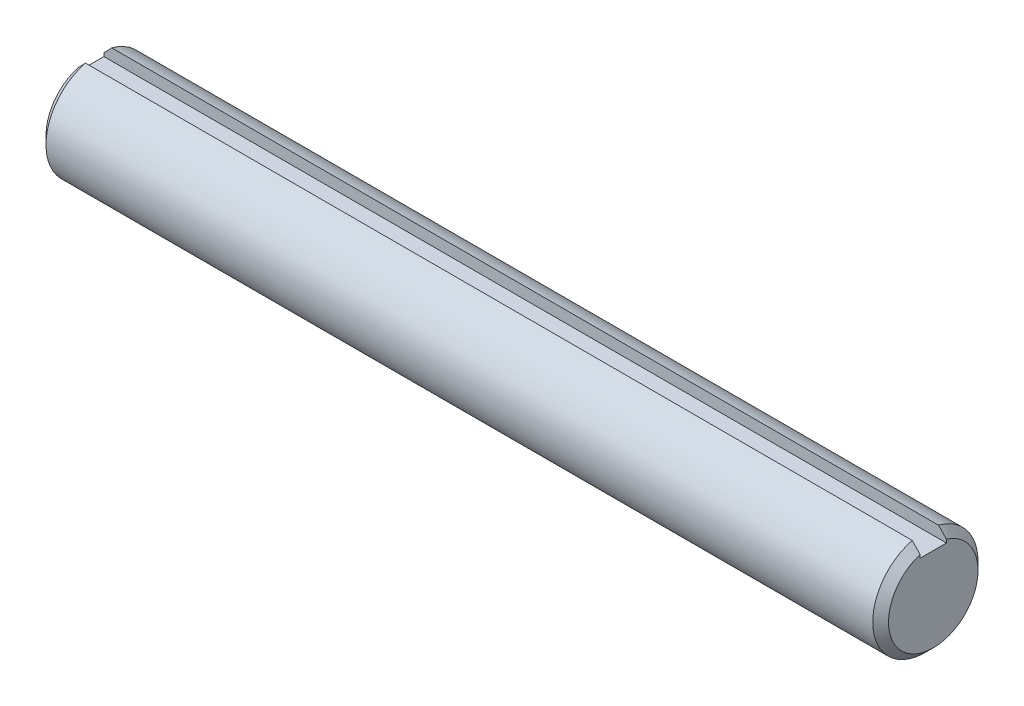
ISO-10303-21;
HEADER;
FILE_DESCRIPTION(('STEP AP214'),'2;1');
FILE_NAME('part.step','',(''),(''),'','','');
FILE_SCHEMA(('AUTOMOTIVE_DESIGN { 1 0 10303 214 1 1 1 1 }'));
ENDSEC;
DATA;
#1=APPLICATION_CONTEXT('core data for automotive mechanical design processes');
#2=APPLICATION_PROTOCOL_DEFINITION('international standard','automotive_design',2000,#1);
#3=PRODUCT_CONTEXT('',#1,'mechanical');
#4=PRODUCT('Part','Part','',(#3));
#5=PRODUCT_RELATED_PRODUCT_CATEGORY('part','',(#4));
#6=PRODUCT_DEFINITION_FORMATION('','',#4);
#7=PRODUCT_DEFINITION_CONTEXT('part definition',#1,'design');
#8=PRODUCT_DEFINITION('design','',#6,#7);
#9=PRODUCT_DEFINITION_SHAPE('','',#8);
#10=(LENGTH_UNIT() NAMED_UNIT(*) SI_UNIT(.MILLI.,.METRE.));
#11=(NAMED_UNIT(*) PLANE_ANGLE_UNIT() SI_UNIT($,.RADIAN.));
#12=(NAMED_UNIT(*) SI_UNIT($,.STERADIAN.) SOLID_ANGLE_UNIT());
#13=UNCERTAINTY_MEASURE_WITH_UNIT(LENGTH_MEASURE(1.E-05),#10,'distance_accuracy_value','');
#14=(GEOMETRIC_REPRESENTATION_CONTEXT(3) GLOBAL_UNCERTAINTY_ASSIGNED_CONTEXT((#13)) GLOBAL_UNIT_ASSIGNED_CONTEXT((#10,
#11,#12)) REPRESENTATION_CONTEXT('',''));
#15=CARTESIAN_POINT('',(0.,0.,0.));
#16=DIRECTION('',(0.,0.,1.));
#17=DIRECTION('',(1.,0.,0.));
#18=AXIS2_PLACEMENT_3D('',#15,#16,#17);
#19=CARTESIAN_POINT('',(152.4,0.,0.));
#20=DIRECTION('',(-1.,0.,0.));
#21=DIRECTION('',(0.,0.,1.));
#22=AXIS2_PLACEMENT_3D('',#19,#20,#21);
#23=CYLINDRICAL_SURFACE('',#22,19.05);
#24=CARTESIAN_POINT('',(-149.5425,0.,0.));
#25=DIRECTION('',(1.,0.,0.));
#26=DIRECTION('',(0.,0.,-1.));
#27=AXIS2_PLACEMENT_3D('',#24,#25,#26);
#28=CIRCLE('',#27,19.05);
#29=CARTESIAN_POINT('',(-149.5425,18.4450831863128,4.7625));
#30=VERTEX_POINT('',#29);
#31=CARTESIAN_POINT('',(-149.5425,18.4450831863128,-4.7625));
#32=VERTEX_POINT('',#31);
#33=EDGE_CURVE('E154',#30,#32,#28,.T.);
#34=ORIENTED_EDGE('',*,*,#33,.T.);
#35=DIRECTION('',(-1.,0.,0.));
#36=VECTOR('',#35,1.);
#37=CARTESIAN_POINT('',(152.4,18.4450831863128,-4.7625));
#38=LINE('',#37,#36);
#39=CARTESIAN_POINT('',(149.5425,18.4450831863128,-4.7625));
#40=VERTEX_POINT('',#39);
#41=EDGE_CURVE('E68',#32,#40,#38,.F.);
#42=ORIENTED_EDGE('',*,*,#41,.T.);
#43=CARTESIAN_POINT('',(149.5425,0.,0.));
#44=DIRECTION('',(1.,0.,0.));
#45=DIRECTION('',(0.,0.,-1.));
#46=AXIS2_PLACEMENT_3D('',#43,#44,#45);
#47=CIRCLE('',#46,19.05);
#48=CARTESIAN_POINT('',(149.5425,18.4450831863128,4.7625));
#49=VERTEX_POINT('',#48);
#50=EDGE_CURVE('E157',#40,#49,#47,.F.);
#51=ORIENTED_EDGE('',*,*,#50,.T.);
#52=DIRECTION('',(-1.,0.,0.));
#53=VECTOR('',#52,1.);
#54=CARTESIAN_POINT('',(152.4,18.4450831863128,4.7625));
#55=LINE('',#54,#53);
#56=EDGE_CURVE('E61',#49,#30,#55,.T.);
#57=ORIENTED_EDGE('',*,*,#56,.T.);
#58=EDGE_LOOP('',(#34,#42,#51,#57));
#59=FACE_BOUND('',#58,.T.);
#60=ADVANCED_FACE('F41',(#59),#23,.T.);
#61=CARTESIAN_POINT('',(152.4,0.,0.));
#62=DIRECTION('',(1.,0.,0.));
#63=DIRECTION('',(0.,0.,-1.));
#64=AXIS2_PLACEMENT_3D('',#61,#62,#63);
#65=PLANE('',#64);
#66=DIRECTION('',(0.,-1.,0.));
#67=VECTOR('',#66,1.);
#68=CARTESIAN_POINT('',(152.4,19.05,-4.7625));
#69=LINE('',#68,#67);
#70=CARTESIAN_POINT('',(152.4,15.4762931608316,-4.7625));
#71=VERTEX_POINT('',#70);
#72=CARTESIAN_POINT('',(152.4,14.2875,-4.7625));
#73=VERTEX_POINT('',#72);
#74=EDGE_CURVE('E121',#71,#73,#69,.T.);
#75=ORIENTED_EDGE('',*,*,#74,.T.);
#76=DIRECTION('',(0.,0.,1.));
#77=VECTOR('',#76,1.);
#78=CARTESIAN_POINT('',(152.4,14.2875,-4.7625));
#79=LINE('',#78,#77);
#80=CARTESIAN_POINT('',(152.4,14.2875,4.7625));
#81=VERTEX_POINT('',#80);
#82=EDGE_CURVE('E113',#73,#81,#79,.T.);
#83=ORIENTED_EDGE('',*,*,#82,.T.);
#84=DIRECTION('',(0.,1.,0.));
#85=VECTOR('',#84,1.);
#86=CARTESIAN_POINT('',(152.4,19.05,4.7625));
#87=LINE('',#86,#85);
#88=CARTESIAN_POINT('',(152.4,15.4762931608316,4.7625));
#89=VERTEX_POINT('',#88);
#90=EDGE_CURVE('E116',#81,#89,#87,.T.);
#91=ORIENTED_EDGE('',*,*,#90,.T.);
#92=CARTESIAN_POINT('',(152.4,0.,0.));
#93=DIRECTION('',(1.,0.,0.));
#94=DIRECTION('',(0.,0.,-1.));
#95=AXIS2_PLACEMENT_3D('',#92,#93,#94);
#96=CIRCLE('',#95,16.1925000000001);
#97=EDGE_CURVE('E149',#89,#71,#96,.T.);
#98=ORIENTED_EDGE('',*,*,#97,.T.);
#99=EDGE_LOOP('',(#75,#83,#91,#98));
#100=FACE_BOUND('',#99,.T.);
#101=ADVANCED_FACE('F165',(#100),#65,.T.);
#102=CARTESIAN_POINT('',(-152.4,0.,0.));
#103=DIRECTION('',(1.,0.,0.));
#104=DIRECTION('',(0.,0.,-1.));
#105=AXIS2_PLACEMENT_3D('',#102,#103,#104);
#106=PLANE('',#105);
#107=DIRECTION('',(0.,0.,1.));
#108=VECTOR('',#107,1.);
#109=CARTESIAN_POINT('',(-152.4,14.2875,-4.7625));
#110=LINE('',#109,#108);
#111=CARTESIAN_POINT('',(-152.4,14.2875,-4.7625));
#112=VERTEX_POINT('',#111);
#113=CARTESIAN_POINT('',(-152.4,14.2875,4.7625));
#114=VERTEX_POINT('',#113);
#115=EDGE_CURVE('E106',#112,#114,#110,.T.);
#116=ORIENTED_EDGE('',*,*,#115,.F.);
#117=DIRECTION('',(0.,-1.,0.));
#118=VECTOR('',#117,1.);
#119=CARTESIAN_POINT('',(-152.4,19.05,-4.7625));
#120=LINE('',#119,#118);
#121=CARTESIAN_POINT('',(-152.4,15.4762931608313,-4.7625));
#122=VERTEX_POINT('',#121);
#123=EDGE_CURVE('E96',#122,#112,#120,.T.);
#124=ORIENTED_EDGE('',*,*,#123,.F.);
#125=CARTESIAN_POINT('',(-152.4,0.,0.));
#126=DIRECTION('',(1.,0.,0.));
#127=DIRECTION('',(0.,0.,-1.));
#128=AXIS2_PLACEMENT_3D('',#125,#126,#127);
#129=CIRCLE('',#128,16.1924999999998);
#130=CARTESIAN_POINT('',(-152.4,15.4762931608313,4.7625));
#131=VERTEX_POINT('',#130);
#132=EDGE_CURVE('E152',#122,#131,#129,.F.);
#133=ORIENTED_EDGE('',*,*,#132,.T.);
#134=DIRECTION('',(0.,1.,0.));
#135=VECTOR('',#134,1.);
#136=CARTESIAN_POINT('',(-152.4,19.05,4.7625));
#137=LINE('',#136,#135);
#138=EDGE_CURVE('E119',#114,#131,#137,.T.);
#139=ORIENTED_EDGE('',*,*,#138,.F.);
#140=EDGE_LOOP('',(#116,#124,#133,#139));
#141=FACE_BOUND('',#140,.T.);
#142=ADVANCED_FACE('F118',(#141),#106,.F.);
#143=CARTESIAN_POINT('',(-149.5425,0.,0.));
#144=DIRECTION('',(1.,0.,0.));
#145=DIRECTION('',(0.,0.,-1.));
#146=AXIS2_PLACEMENT_3D('',#143,#144,#145);
#147=CONICAL_SURFACE('',#146,19.05,0.785398163397447);
#148=CARTESIAN_POINT('',(-144.794260766506,23.3168347844346,-4.7625));
#149=CARTESIAN_POINT('',(-145.427699083531,22.6702708993323,-4.7625));
#150=CARTESIAN_POINT('',(-146.060644862527,22.0232225621981,-4.7625));
#151=CARTESIAN_POINT('',(-147.32512201228,20.727768038423,-4.7625));
#152=CARTESIAN_POINT('',(-147.956653407936,20.0793618760807,-4.7625));
#153=CARTESIAN_POINT('',(-149.2177647222,18.7809139414571,-4.7625));
#154=CARTESIAN_POINT('',(-149.847345016921,18.1308725346506,-4.7625));
#155=CARTESIAN_POINT('',(-151.1040393077,16.8283791725783,-4.7625));
#156=CARTESIAN_POINT('',(-151.731153248613,16.1759271640393,-4.7625));
#157=CARTESIAN_POINT('',(-152.669273027445,15.1946328812362,-4.7625));
#158=CARTESIAN_POINT('',(-152.981598445328,14.8670522038404,-4.7625));
#159=CARTESIAN_POINT('',(-153.605177100854,14.2108726658294,-4.7625));
#160=CARTESIAN_POINT('',(-153.916430340605,13.8822738072203,-4.7625));
#161=CARTESIAN_POINT('',(-154.537610716478,13.2238579119962,-4.7625));
#162=CARTESIAN_POINT('',(-154.84753792318,12.894040942004,-4.7625));
#163=CARTESIAN_POINT('',(-155.465768564033,12.2328826111413,-4.7625));
#164=CARTESIAN_POINT('',(-155.774071985563,11.9015412384587,-4.7625));
#165=CARTESIAN_POINT('',(-156.388701378239,11.2368727270126,-4.7625));
#166=CARTESIAN_POINT('',(-156.695026829786,10.9035451074248,-4.7625));
#167=CARTESIAN_POINT('',(-157.305026212234,10.2344808282248,-4.7625));
#168=CARTESIAN_POINT('',(-157.608700201395,9.89874422184073,-4.7625));
#169=CARTESIAN_POINT('',(-158.061610417643,9.39275530107409,-4.7625));
#170=CARTESIAN_POINT('',(-158.212160893573,9.2236791745557,-4.7625));
#171=CARTESIAN_POINT('',(-158.512238050459,8.88462197634279,-4.7625));
#172=CARTESIAN_POINT('',(-158.661764737203,8.71464090977368,-4.7625));
#173=CARTESIAN_POINT('',(-158.959636404079,8.37362334696036,-4.7625));
#174=CARTESIAN_POINT('',(-159.107981296745,8.20258677422876,-4.7625));
#175=CARTESIAN_POINT('',(-159.403253933016,7.85928938308822,-4.7625));
#176=CARTESIAN_POINT('',(-159.55018164871,7.68702854068365,-4.7625));
#177=CARTESIAN_POINT('',(-159.696285680867,7.51406833625713,-4.7625));
#178=B_SPLINE_CURVE_WITH_KNOTS('',3,(#148,#149,#150,#151,#152,#153,#154,#155,#156,#157,#158,
#159,#160,#161,#162,#163,#164,#165,#166,#167,#168,#169,#170,#171,#172,#173,#174,#175,#176,#177),
.UNSPECIFIED.,.F.,.F.,(4,2,2,2,2,2,2,2,2,2,2,2,2,2,4),(0.,2.71543931136989,5.43083043746166,
8.14566073301573,10.8605513882733,12.2183810382296,13.5762080146472,14.9339617953621,
16.2917261147768,17.649833675453,19.0079113195965,19.6870763405056,20.3662375188258,
21.0454485044949,21.7246728395846),.UNSPECIFIED.);
#179=EDGE_CURVE('E101',#32,#122,#178,.T.);
#180=ORIENTED_EDGE('',*,*,#179,.F.);
#181=ORIENTED_EDGE('',*,*,#33,.F.);
#182=CARTESIAN_POINT('',(-159.696285680867,7.51406833625713,4.7625));
#183=CARTESIAN_POINT('',(-159.55018164871,7.68702854068365,4.7625));
#184=CARTESIAN_POINT('',(-159.403253933016,7.85928938308822,4.7625));
#185=CARTESIAN_POINT('',(-159.107981296745,8.20258677422875,4.7625));
#186=CARTESIAN_POINT('',(-158.959636404079,8.37362334696035,4.7625));
#187=CARTESIAN_POINT('',(-158.661764737203,8.71464090977366,4.7625));
#188=CARTESIAN_POINT('',(-158.512238050459,8.88462197634277,4.7625));
#189=CARTESIAN_POINT('',(-158.212160893573,9.22367917455569,4.7625));
#190=CARTESIAN_POINT('',(-158.061610417643,9.39275530107408,4.7625));
#191=CARTESIAN_POINT('',(-157.608700201395,9.89874422184073,4.7625));
#192=CARTESIAN_POINT('',(-157.305026212234,10.2344808282248,4.7625));
#193=CARTESIAN_POINT('',(-156.695026829786,10.9035451074248,4.7625));
#194=CARTESIAN_POINT('',(-156.388701378239,11.2368727270126,4.7625));
#195=CARTESIAN_POINT('',(-155.774071985563,11.9015412384587,4.7625));
#196=CARTESIAN_POINT('',(-155.465768564033,12.2328826111413,4.7625));
#197=CARTESIAN_POINT('',(-154.84753792318,12.894040942004,4.7625));
#198=CARTESIAN_POINT('',(-154.537610716478,13.2238579119963,4.7625));
#199=CARTESIAN_POINT('',(-153.916430340605,13.8822738072203,4.7625));
#200=CARTESIAN_POINT('',(-153.605177100854,14.2108726658294,4.7625));
#201=CARTESIAN_POINT('',(-152.981598445329,14.8670522038404,4.7625));
#202=CARTESIAN_POINT('',(-152.669273027445,15.1946328812362,4.7625));
#203=CARTESIAN_POINT('',(-151.731153248613,16.1759271640393,4.7625));
#204=CARTESIAN_POINT('',(-151.1040393077,16.8283791725783,4.7625));
#205=CARTESIAN_POINT('',(-149.847345016921,18.1308725346506,4.7625));
#206=CARTESIAN_POINT('',(-149.2177647222,18.7809139414572,4.7625));
#207=CARTESIAN_POINT('',(-147.956653407936,20.0793618760807,4.7625));
#208=CARTESIAN_POINT('',(-147.32512201228,20.727768038423,4.7625));
#209=CARTESIAN_POINT('',(-146.060644862527,22.0232225621981,4.7625));
#210=CARTESIAN_POINT('',(-145.427699083531,22.6702708993323,4.7625));
#211=CARTESIAN_POINT('',(-144.794260766506,23.3168347844346,4.7625));
#212=B_SPLINE_CURVE_WITH_KNOTS('',3,(#182,#183,#184,#185,#186,#187,#188,#189,#190,#191,#192,
#193,#194,#195,#196,#197,#198,#199,#200,#201,#202,#203,#204,#205,#206,#207,#208,#209,#210,#211),
.UNSPECIFIED.,.F.,.F.,(4,2,2,2,2,2,2,2,2,2,2,2,2,2,4),(0.,0.679224335089691,1.35843532075879,
2.03759649907897,2.71676151998805,4.07483916413154,5.43294672480773,6.79071104422245,
8.14846482493736,9.50629180135492,10.8641214513112,13.5790121065688,16.2938424021229,
19.0092335282147,21.7246728395846),.UNSPECIFIED.);
#213=EDGE_CURVE('E130',#131,#30,#212,.T.);
#214=ORIENTED_EDGE('',*,*,#213,.F.);
#215=ORIENTED_EDGE('',*,*,#132,.F.);
#216=EDGE_LOOP('',(#180,#181,#214,#215));
#217=FACE_BOUND('',#216,.T.);
#218=ADVANCED_FACE('F137',(#217),#147,.T.);
#219=CARTESIAN_POINT('',(152.4,0.,0.));
#220=DIRECTION('',(-1.,0.,0.));
#221=DIRECTION('',(0.,0.,1.));
#222=AXIS2_PLACEMENT_3D('',#219,#220,#221);
#223=CONICAL_SURFACE('',#222,16.1925000000001,0.785398163397452);
#224=CARTESIAN_POINT('',(159.696285680867,7.5140683362573,-4.7625));
#225=CARTESIAN_POINT('',(159.550181648711,7.68702854068382,-4.7625));
#226=CARTESIAN_POINT('',(159.403253933016,7.85928938308839,-4.7625));
#227=CARTESIAN_POINT('',(159.107981296745,8.20258677422892,-4.7625));
#228=CARTESIAN_POINT('',(158.959636404079,8.37362334696052,-4.7625));
#229=CARTESIAN_POINT('',(158.661764737203,8.71464090977384,-4.7625));
#230=CARTESIAN_POINT('',(158.512238050459,8.88462197634295,-4.7625));
#231=CARTESIAN_POINT('',(158.212160893573,9.22367917455586,-4.7625));
#232=CARTESIAN_POINT('',(158.061610417643,9.39275530107425,-4.7625));
#233=CARTESIAN_POINT('',(157.608700201395,9.89874422184088,-4.7625));
#234=CARTESIAN_POINT('',(157.305026212234,10.2344808282249,-4.7625));
#235=CARTESIAN_POINT('',(156.695026829786,10.903545107425,-4.7625));
#236=CARTESIAN_POINT('',(156.388701378239,11.2368727270127,-4.7625));
#237=CARTESIAN_POINT('',(155.774071985563,11.9015412384588,-4.7625));
#238=CARTESIAN_POINT('',(155.465768564034,12.2328826111414,-4.7625));
#239=CARTESIAN_POINT('',(154.84753792318,12.8940409420041,-4.7625));
#240=CARTESIAN_POINT('',(154.537610716478,13.2238579119964,-4.7625));
#241=CARTESIAN_POINT('',(153.916430340605,13.8822738072203,-4.7625));
#242=CARTESIAN_POINT('',(153.605177100854,14.2108726658295,-4.7625));
#243=CARTESIAN_POINT('',(152.981598445329,14.8670522038405,-4.7625));
#244=CARTESIAN_POINT('',(152.669273027445,15.1946328812363,-4.7625));
#245=CARTESIAN_POINT('',(151.731153248613,16.1759271640393,-4.7625));
#246=CARTESIAN_POINT('',(151.1040393077,16.8283791725783,-4.7625));
#247=CARTESIAN_POINT('',(149.847345016921,18.1308725346506,-4.7625));
#248=CARTESIAN_POINT('',(149.2177647222,18.7809139414572,-4.7625));
#249=CARTESIAN_POINT('',(147.956653407937,20.0793618760807,-4.7625));
#250=CARTESIAN_POINT('',(147.325122012281,20.727768038423,-4.7625));
#251=CARTESIAN_POINT('',(146.060644862528,22.0232225621981,-4.7625));
#252=CARTESIAN_POINT('',(145.427699083532,22.6702708993322,-4.7625));
#253=CARTESIAN_POINT('',(144.794260766506,23.3168347844346,-4.7625));
#254=B_SPLINE_CURVE_WITH_KNOTS('',3,(#224,#225,#226,#227,#228,#229,#230,#231,#232,#233,#234,
#235,#236,#237,#238,#239,#240,#241,#242,#243,#244,#245,#246,#247,#248,#249,#250,#251,#252,#253),
.UNSPECIFIED.,.F.,.F.,(4,2,2,2,2,2,2,2,2,2,2,2,2,2,4),(0.,0.679224335089666,1.35843532075877,
2.03759649907897,2.71676151998802,4.0748391641315,5.43294672480766,6.79071104422233,
8.14846482493721,9.50629180135476,10.864121451311,13.5790121065686,16.2938424021226,
19.0092335282143,21.7246728395842),.UNSPECIFIED.);
#255=EDGE_CURVE('E11',#71,#40,#254,.T.);
#256=ORIENTED_EDGE('',*,*,#255,.F.);
#257=ORIENTED_EDGE('',*,*,#97,.F.);
#258=CARTESIAN_POINT('',(144.794260766506,23.3168347844346,4.7625));
#259=CARTESIAN_POINT('',(145.427699083532,22.6702708993322,4.7625));
#260=CARTESIAN_POINT('',(146.060644862528,22.0232225621981,4.7625));
#261=CARTESIAN_POINT('',(147.325122012281,20.727768038423,4.7625));
#262=CARTESIAN_POINT('',(147.956653407937,20.0793618760807,4.7625));
#263=CARTESIAN_POINT('',(149.2177647222,18.7809139414572,4.7625));
#264=CARTESIAN_POINT('',(149.847345016921,18.1308725346506,4.7625));
#265=CARTESIAN_POINT('',(151.1040393077,16.8283791725783,4.7625));
#266=CARTESIAN_POINT('',(151.731153248613,16.1759271640393,4.7625));
#267=CARTESIAN_POINT('',(152.669273027445,15.1946328812363,4.7625));
#268=CARTESIAN_POINT('',(152.981598445329,14.8670522038405,4.7625));
#269=CARTESIAN_POINT('',(153.605177100854,14.2108726658295,4.7625));
#270=CARTESIAN_POINT('',(153.916430340605,13.8822738072203,4.7625));
#271=CARTESIAN_POINT('',(154.537610716478,13.2238579119964,4.7625));
#272=CARTESIAN_POINT('',(154.84753792318,12.8940409420041,4.7625));
#273=CARTESIAN_POINT('',(155.465768564034,12.2328826111414,4.7625));
#274=CARTESIAN_POINT('',(155.774071985563,11.9015412384588,4.7625));
#275=CARTESIAN_POINT('',(156.388701378239,11.2368727270127,4.7625));
#276=CARTESIAN_POINT('',(156.695026829786,10.903545107425,4.7625));
#277=CARTESIAN_POINT('',(157.305026212234,10.2344808282249,4.7625));
#278=CARTESIAN_POINT('',(157.608700201395,9.89874422184088,4.7625));
#279=CARTESIAN_POINT('',(158.061610417643,9.39275530107425,4.7625));
#280=CARTESIAN_POINT('',(158.212160893573,9.22367917455586,4.7625));
#281=CARTESIAN_POINT('',(158.512238050459,8.88462197634295,4.7625));
#282=CARTESIAN_POINT('',(158.661764737203,8.71464090977384,4.7625));
#283=CARTESIAN_POINT('',(158.959636404079,8.37362334696052,4.7625));
#284=CARTESIAN_POINT('',(159.107981296745,8.20258677422892,4.7625));
#285=CARTESIAN_POINT('',(159.403253933016,7.85928938308839,4.7625));
#286=CARTESIAN_POINT('',(159.550181648711,7.68702854068382,4.7625));
#287=CARTESIAN_POINT('',(159.696285680867,7.5140683362573,4.7625));
#288=B_SPLINE_CURVE_WITH_KNOTS('',3,(#258,#259,#260,#261,#262,#263,#264,#265,#266,#267,#268,
#269,#270,#271,#272,#273,#274,#275,#276,#277,#278,#279,#280,#281,#282,#283,#284,#285,#286,#287),
.UNSPECIFIED.,.F.,.F.,(4,2,2,2,2,2,2,2,2,2,2,2,2,2,4),(0.,2.71543931136987,5.4308304374616,
8.14566073301564,10.8605513882732,12.2183810382294,13.576208014647,14.9339617953619,
16.2917261147765,17.6498336754527,19.0079113195962,19.6870763405052,20.3662375188254,
21.0454485044945,21.7246728395842),.UNSPECIFIED.);
#289=EDGE_CURVE('E54',#49,#89,#288,.T.);
#290=ORIENTED_EDGE('',*,*,#289,.F.);
#291=ORIENTED_EDGE('',*,*,#50,.F.);
#292=EDGE_LOOP('',(#256,#257,#290,#291));
#293=FACE_BOUND('',#292,.T.);
#294=ADVANCED_FACE('F43',(#293),#223,.T.);
#295=CARTESIAN_POINT('',(152.4,19.05,-4.7625));
#296=DIRECTION('',(0.,0.,-1.));
#297=DIRECTION('',(-1.,0.,0.));
#298=AXIS2_PLACEMENT_3D('',#295,#296,#297);
#299=PLANE('',#298);
#300=ORIENTED_EDGE('',*,*,#179,.T.);
#301=ORIENTED_EDGE('',*,*,#123,.T.);
#302=DIRECTION('',(-1.,0.,0.));
#303=VECTOR('',#302,1.);
#304=CARTESIAN_POINT('',(152.4,14.2875,-4.7625));
#305=LINE('',#304,#303);
#306=EDGE_CURVE('E99',#73,#112,#305,.T.);
#307=ORIENTED_EDGE('',*,*,#306,.F.);
#308=ORIENTED_EDGE('',*,*,#74,.F.);
#309=ORIENTED_EDGE('',*,*,#255,.T.);
#310=ORIENTED_EDGE('',*,*,#41,.F.);
#311=EDGE_LOOP('',(#300,#301,#307,#308,#309,#310));
#312=FACE_BOUND('',#311,.T.);
#313=ADVANCED_FACE('F98',(#312),#299,.F.);
#314=CARTESIAN_POINT('',(152.4,19.05,4.7625));
#315=DIRECTION('',(0.,0.,1.));
#316=DIRECTION('',(1.,0.,0.));
#317=AXIS2_PLACEMENT_3D('',#314,#315,#316);
#318=PLANE('',#317);
#319=ORIENTED_EDGE('',*,*,#213,.T.);
#320=ORIENTED_EDGE('',*,*,#56,.F.);
#321=ORIENTED_EDGE('',*,*,#289,.T.);
#322=ORIENTED_EDGE('',*,*,#90,.F.);
#323=DIRECTION('',(-1.,0.,0.));
#324=VECTOR('',#323,1.);
#325=CARTESIAN_POINT('',(152.4,14.2875,4.7625));
#326=LINE('',#325,#324);
#327=EDGE_CURVE('E115',#81,#114,#326,.T.);
#328=ORIENTED_EDGE('',*,*,#327,.T.);
#329=ORIENTED_EDGE('',*,*,#138,.T.);
#330=EDGE_LOOP('',(#319,#320,#321,#322,#328,#329));
#331=FACE_BOUND('',#330,.T.);
#332=ADVANCED_FACE('F140',(#331),#318,.F.);
#333=CARTESIAN_POINT('',(152.4,14.2875,-4.7625));
#334=DIRECTION('',(0.,-1.,0.));
#335=DIRECTION('',(0.,0.,-1.));
#336=AXIS2_PLACEMENT_3D('',#333,#334,#335);
#337=PLANE('',#336);
#338=ORIENTED_EDGE('',*,*,#327,.F.);
#339=ORIENTED_EDGE('',*,*,#82,.F.);
#340=ORIENTED_EDGE('',*,*,#306,.T.);
#341=ORIENTED_EDGE('',*,*,#115,.T.);
#342=EDGE_LOOP('',(#338,#339,#340,#341));
#343=FACE_BOUND('',#342,.T.);
#344=ADVANCED_FACE('F110',(#343),#337,.F.);
#345=CLOSED_SHELL('',(#60,#101,#142,#218,#294,#313,#332,#344));
#346=MANIFOLD_SOLID_BREP('B2',#345);
#347=ADVANCED_BREP_SHAPE_REPRESENTATION('',(#18,#346),#14);
#348=SHAPE_DEFINITION_REPRESENTATION(#9,#347);
ENDSEC;
END-ISO-10303-21;
